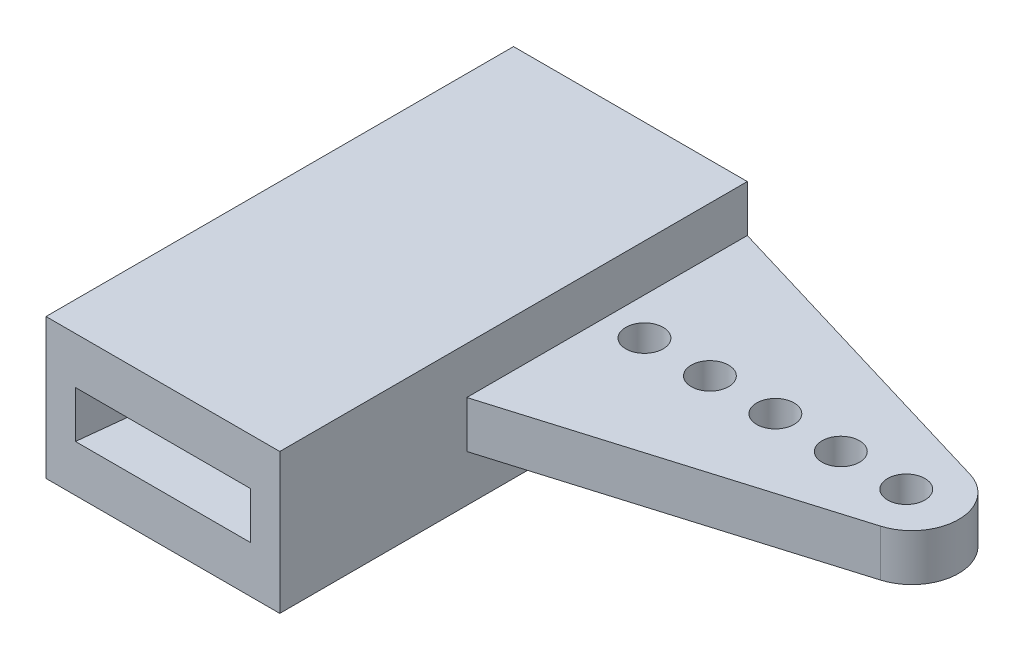
ISO-10303-21;
HEADER;
FILE_DESCRIPTION(('STEP AP214'),'2;1');
FILE_NAME('part.step','',(''),(''),'','','');
FILE_SCHEMA(('AUTOMOTIVE_DESIGN { 1 0 10303 214 1 1 1 1 }'));
ENDSEC;
DATA;
#1=APPLICATION_CONTEXT('core data for automotive mechanical design processes');
#2=APPLICATION_PROTOCOL_DEFINITION('international standard','automotive_design',2000,#1);
#3=PRODUCT_CONTEXT('',#1,'mechanical');
#4=PRODUCT('Part','Part','',(#3));
#5=PRODUCT_RELATED_PRODUCT_CATEGORY('part','',(#4));
#6=PRODUCT_DEFINITION_FORMATION('','',#4);
#7=PRODUCT_DEFINITION_CONTEXT('part definition',#1,'design');
#8=PRODUCT_DEFINITION('design','',#6,#7);
#9=PRODUCT_DEFINITION_SHAPE('','',#8);
#10=(LENGTH_UNIT() NAMED_UNIT(*) SI_UNIT(.MILLI.,.METRE.));
#11=(NAMED_UNIT(*) PLANE_ANGLE_UNIT() SI_UNIT($,.RADIAN.));
#12=(NAMED_UNIT(*) SI_UNIT($,.STERADIAN.) SOLID_ANGLE_UNIT());
#13=UNCERTAINTY_MEASURE_WITH_UNIT(LENGTH_MEASURE(1.E-05),#10,'distance_accuracy_value','');
#14=(GEOMETRIC_REPRESENTATION_CONTEXT(3) GLOBAL_UNCERTAINTY_ASSIGNED_CONTEXT((#13)) GLOBAL_UNIT_ASSIGNED_CONTEXT((#10,
#11,#12)) REPRESENTATION_CONTEXT('',''));
#15=CARTESIAN_POINT('',(0.,0.,0.));
#16=DIRECTION('',(0.,0.,1.));
#17=DIRECTION('',(1.,0.,0.));
#18=AXIS2_PLACEMENT_3D('',#15,#16,#17);
#19=CARTESIAN_POINT('',(0.,3.556,0.));
#20=DIRECTION('',(0.,1.,0.));
#21=DIRECTION('',(0.,0.,1.));
#22=AXIS2_PLACEMENT_3D('',#19,#20,#21);
#23=PLANE('',#22);
#24=CARTESIAN_POINT('',(11.303,3.556,-12.7));
#25=DIRECTION('',(0.,1.,0.));
#26=DIRECTION('',(0.,0.,1.));
#27=AXIS2_PLACEMENT_3D('',#24,#25,#26);
#28=CIRCLE('',#27,0.508000000000002);
#29=CARTESIAN_POINT('',(11.303,3.556,-12.192));
#30=VERTEX_POINT('',#29);
#31=EDGE_CURVE('E215',#30,#30,#28,.T.);
#32=ORIENTED_EDGE('',*,*,#31,.F.);
#33=EDGE_LOOP('',(#32));
#34=FACE_BOUND('',#33,.T.);
#35=CARTESIAN_POINT('',(9.525,3.556,-12.7));
#36=DIRECTION('',(0.,1.,0.));
#37=DIRECTION('',(0.,0.,1.));
#38=AXIS2_PLACEMENT_3D('',#35,#36,#37);
#39=CIRCLE('',#38,0.507999999999998);
#40=CARTESIAN_POINT('',(9.525,3.556,-12.192));
#41=VERTEX_POINT('',#40);
#42=EDGE_CURVE('E219',#41,#41,#39,.T.);
#43=ORIENTED_EDGE('',*,*,#42,.F.);
#44=EDGE_LOOP('',(#43));
#45=FACE_BOUND('',#44,.T.);
#46=CARTESIAN_POINT('',(7.747,3.556,-12.7));
#47=DIRECTION('',(0.,1.,0.));
#48=DIRECTION('',(0.,0.,1.));
#49=AXIS2_PLACEMENT_3D('',#46,#47,#48);
#50=CIRCLE('',#49,0.508000000000001);
#51=CARTESIAN_POINT('',(7.747,3.556,-12.192));
#52=VERTEX_POINT('',#51);
#53=EDGE_CURVE('E273',#52,#52,#50,.T.);
#54=ORIENTED_EDGE('',*,*,#53,.F.);
#55=EDGE_LOOP('',(#54));
#56=FACE_BOUND('',#55,.T.);
#57=CARTESIAN_POINT('',(5.969,3.556,-12.7));
#58=DIRECTION('',(0.,1.,0.));
#59=DIRECTION('',(0.,0.,1.));
#60=AXIS2_PLACEMENT_3D('',#57,#58,#59);
#61=CIRCLE('',#60,0.508);
#62=CARTESIAN_POINT('',(5.969,3.556,-12.192));
#63=VERTEX_POINT('',#62);
#64=EDGE_CURVE('E239',#63,#63,#61,.T.);
#65=ORIENTED_EDGE('',*,*,#64,.F.);
#66=EDGE_LOOP('',(#65));
#67=FACE_BOUND('',#66,.T.);
#68=CARTESIAN_POINT('',(4.191,3.556,-12.7));
#69=DIRECTION('',(0.,1.,0.));
#70=DIRECTION('',(0.,0.,1.));
#71=AXIS2_PLACEMENT_3D('',#68,#69,#70);
#72=CIRCLE('',#71,0.508);
#73=CARTESIAN_POINT('',(4.191,3.556,-12.192));
#74=VERTEX_POINT('',#73);
#75=EDGE_CURVE('E227',#74,#74,#72,.T.);
#76=ORIENTED_EDGE('',*,*,#75,.F.);
#77=EDGE_LOOP('',(#76));
#78=FACE_BOUND('',#77,.T.);
#79=DIRECTION('',(-0.957826285221151,0.,0.287347885566346));
#80=VECTOR('',#79,1.);
#81=CARTESIAN_POINT('',(-2.18463302752294,3.556,-7.28211009174312));
#82=LINE('',#81,#80);
#83=CARTESIAN_POINT('',(11.8202020592305,3.556,-11.4835606177691));
#84=VERTEX_POINT('',#83);
#85=CARTESIAN_POINT('',(3.175,3.556,-8.89));
#86=VERTEX_POINT('',#85);
#87=EDGE_CURVE('E236',#84,#86,#82,.T.);
#88=ORIENTED_EDGE('',*,*,#87,.F.);
#89=CARTESIAN_POINT('',(11.4552702445612,3.556,-12.7));
#90=DIRECTION('',(0.,1.,0.));
#91=DIRECTION('',(0.,0.,1.));
#92=AXIS2_PLACEMENT_3D('',#89,#90,#91);
#93=CIRCLE('',#92,1.27);
#94=CARTESIAN_POINT('',(11.8202020592305,3.556,-13.9164393822309));
#95=VERTEX_POINT('',#94);
#96=EDGE_CURVE('E11',#84,#95,#93,.T.);
#97=ORIENTED_EDGE('',*,*,#96,.T.);
#98=DIRECTION('',(0.957826285221152,0.,0.287347885566345));
#99=VECTOR('',#98,1.);
#100=CARTESIAN_POINT('',(4.80619266055045,3.556,-16.0206422018349));
#101=LINE('',#100,#99);
#102=CARTESIAN_POINT('',(3.175,3.556,-16.51));
#103=VERTEX_POINT('',#102);
#104=EDGE_CURVE('E230',#103,#95,#101,.T.);
#105=ORIENTED_EDGE('',*,*,#104,.F.);
#106=DIRECTION('',(0.,0.,1.));
#107=VECTOR('',#106,1.);
#108=CARTESIAN_POINT('',(3.175,3.556,0.));
#109=LINE('',#108,#107);
#110=EDGE_CURVE('E141',#103,#86,#109,.T.);
#111=ORIENTED_EDGE('',*,*,#110,.T.);
#112=EDGE_LOOP('',(#88,#97,#105,#111));
#113=FACE_BOUND('',#112,.T.);
#114=ADVANCED_FACE('F47',(#34,#45,#56,#67,#78,#113),#23,.T.);
#115=CARTESIAN_POINT('',(0.,26.4512505991963,-3.81));
#116=DIRECTION('',(0.,0.,1.));
#117=DIRECTION('',(1.,0.,0.));
#118=AXIS2_PLACEMENT_3D('',#115,#116,#117);
#119=PLANE('',#118);
#120=DIRECTION('',(1.,0.,0.));
#121=VECTOR('',#120,1.);
#122=CARTESIAN_POINT('',(0.,4.826,-3.81));
#123=LINE('',#122,#121);
#124=CARTESIAN_POINT('',(-3.175,4.826,-3.81));
#125=VERTEX_POINT('',#124);
#126=CARTESIAN_POINT('',(3.175,4.826,-3.81));
#127=VERTEX_POINT('',#126);
#128=EDGE_CURVE('E157',#125,#127,#123,.T.);
#129=ORIENTED_EDGE('',*,*,#128,.F.);
#130=DIRECTION('',(0.,-1.,0.));
#131=VECTOR('',#130,1.);
#132=CARTESIAN_POINT('',(-3.175,26.4512505991963,-3.81));
#133=LINE('',#132,#131);
#134=CARTESIAN_POINT('',(-3.175,1.016,-3.81));
#135=VERTEX_POINT('',#134);
#136=EDGE_CURVE('E220',#125,#135,#133,.T.);
#137=ORIENTED_EDGE('',*,*,#136,.T.);
#138=DIRECTION('',(-1.,0.,0.));
#139=VECTOR('',#138,1.);
#140=CARTESIAN_POINT('',(3.175,1.016,-3.81));
#141=LINE('',#140,#139);
#142=CARTESIAN_POINT('',(3.175,1.016,-3.81));
#143=VERTEX_POINT('',#142);
#144=EDGE_CURVE('E181',#143,#135,#141,.T.);
#145=ORIENTED_EDGE('',*,*,#144,.F.);
#146=DIRECTION('',(0.,-1.,0.));
#147=VECTOR('',#146,1.);
#148=CARTESIAN_POINT('',(3.175,26.4512505991963,-3.81));
#149=LINE('',#148,#147);
#150=EDGE_CURVE('E235',#127,#143,#149,.T.);
#151=ORIENTED_EDGE('',*,*,#150,.F.);
#152=EDGE_LOOP('',(#129,#137,#145,#151));
#153=FACE_BOUND('',#152,.T.);
#154=DIRECTION('',(0.,1.,0.));
#155=VECTOR('',#154,1.);
#156=CARTESIAN_POINT('',(-2.37490529268971,26.4512505991963,-3.81));
#157=LINE('',#156,#155);
#158=CARTESIAN_POINT('',(-2.37490529268971,2.286,-3.81));
#159=VERTEX_POINT('',#158);
#160=CARTESIAN_POINT('',(-2.37490529268971,3.556,-3.81));
#161=VERTEX_POINT('',#160);
#162=EDGE_CURVE('E203',#159,#161,#157,.T.);
#163=ORIENTED_EDGE('',*,*,#162,.T.);
#164=DIRECTION('',(1.,0.,0.));
#165=VECTOR('',#164,1.);
#166=CARTESIAN_POINT('',(0.,3.556,-3.81));
#167=LINE('',#166,#165);
#168=CARTESIAN_POINT('',(2.37490529268971,3.556,-3.81));
#169=VERTEX_POINT('',#168);
#170=EDGE_CURVE('E165',#161,#169,#167,.T.);
#171=ORIENTED_EDGE('',*,*,#170,.T.);
#172=DIRECTION('',(0.,1.,0.));
#173=VECTOR('',#172,1.);
#174=CARTESIAN_POINT('',(2.37490529268971,26.4512505991963,-3.81));
#175=LINE('',#174,#173);
#176=CARTESIAN_POINT('',(2.37490529268971,2.286,-3.81));
#177=VERTEX_POINT('',#176);
#178=EDGE_CURVE('E214',#177,#169,#175,.T.);
#179=ORIENTED_EDGE('',*,*,#178,.F.);
#180=DIRECTION('',(-1.,0.,0.));
#181=VECTOR('',#180,1.);
#182=CARTESIAN_POINT('',(3.175,2.286,-3.81));
#183=LINE('',#182,#181);
#184=EDGE_CURVE('E182',#177,#159,#183,.T.);
#185=ORIENTED_EDGE('',*,*,#184,.T.);
#186=EDGE_LOOP('',(#163,#171,#179,#185));
#187=FACE_BOUND('',#186,.T.);
#188=ADVANCED_FACE('F331',(#153,#187),#119,.T.);
#189=CARTESIAN_POINT('',(0.,2.286,0.));
#190=DIRECTION('',(0.,-1.,0.));
#191=DIRECTION('',(0.,0.,-1.));
#192=AXIS2_PLACEMENT_3D('',#189,#190,#191);
#193=PLANE('',#192);
#194=DIRECTION('',(0.957826285221152,0.,0.287347885566345));
#195=VECTOR('',#194,1.);
#196=CARTESIAN_POINT('',(4.80619266055045,2.286,-16.0206422018349));
#197=LINE('',#196,#195);
#198=CARTESIAN_POINT('',(3.175,2.286,-16.51));
#199=VERTEX_POINT('',#198);
#200=CARTESIAN_POINT('',(11.8202020592305,2.286,-13.9164393822309));
#201=VERTEX_POINT('',#200);
#202=EDGE_CURVE('E243',#199,#201,#197,.T.);
#203=ORIENTED_EDGE('',*,*,#202,.T.);
#204=CARTESIAN_POINT('',(11.4552702445612,2.286,-12.7));
#205=DIRECTION('',(0.,-1.,0.));
#206=DIRECTION('',(0.,0.,-1.));
#207=AXIS2_PLACEMENT_3D('',#204,#205,#206);
#208=CIRCLE('',#207,1.27);
#209=CARTESIAN_POINT('',(11.8202020592305,2.286,-11.4835606177691));
#210=VERTEX_POINT('',#209);
#211=EDGE_CURVE('E70',#201,#210,#208,.T.);
#212=ORIENTED_EDGE('',*,*,#211,.T.);
#213=DIRECTION('',(-0.957826285221151,0.,0.287347885566346));
#214=VECTOR('',#213,1.);
#215=CARTESIAN_POINT('',(-2.18463302752294,2.286,-7.28211009174312));
#216=LINE('',#215,#214);
#217=CARTESIAN_POINT('',(3.175,2.286,-8.89));
#218=VERTEX_POINT('',#217);
#219=EDGE_CURVE('E240',#210,#218,#216,.T.);
#220=ORIENTED_EDGE('',*,*,#219,.T.);
#221=DIRECTION('',(0.,0.,1.));
#222=VECTOR('',#221,1.);
#223=CARTESIAN_POINT('',(3.175,2.286,-3.81));
#224=LINE('',#223,#222);
#225=EDGE_CURVE('E147',#199,#218,#224,.T.);
#226=ORIENTED_EDGE('',*,*,#225,.F.);
#227=EDGE_LOOP('',(#203,#212,#220,#226));
#228=FACE_BOUND('',#227,.T.);
#229=CARTESIAN_POINT('',(11.303,2.286,-12.7));
#230=DIRECTION('',(0.,1.,0.));
#231=DIRECTION('',(0.,0.,1.));
#232=AXIS2_PLACEMENT_3D('',#229,#230,#231);
#233=CIRCLE('',#232,0.508000000000002);
#234=CARTESIAN_POINT('',(11.303,2.286,-12.192));
#235=VERTEX_POINT('',#234);
#236=EDGE_CURVE('E223',#235,#235,#233,.T.);
#237=ORIENTED_EDGE('',*,*,#236,.T.);
#238=EDGE_LOOP('',(#237));
#239=FACE_BOUND('',#238,.T.);
#240=CARTESIAN_POINT('',(7.747,2.286,-12.7));
#241=DIRECTION('',(0.,1.,0.));
#242=DIRECTION('',(0.,0.,1.));
#243=AXIS2_PLACEMENT_3D('',#240,#241,#242);
#244=CIRCLE('',#243,0.508000000000001);
#245=CARTESIAN_POINT('',(7.747,2.286,-12.192));
#246=VERTEX_POINT('',#245);
#247=EDGE_CURVE('E252',#246,#246,#244,.T.);
#248=ORIENTED_EDGE('',*,*,#247,.T.);
#249=EDGE_LOOP('',(#248));
#250=FACE_BOUND('',#249,.T.);
#251=CARTESIAN_POINT('',(4.191,2.286,-12.7));
#252=DIRECTION('',(0.,1.,0.));
#253=DIRECTION('',(0.,0.,1.));
#254=AXIS2_PLACEMENT_3D('',#251,#252,#253);
#255=CIRCLE('',#254,0.508);
#256=CARTESIAN_POINT('',(4.191,2.286,-12.192));
#257=VERTEX_POINT('',#256);
#258=EDGE_CURVE('E247',#257,#257,#255,.T.);
#259=ORIENTED_EDGE('',*,*,#258,.T.);
#260=EDGE_LOOP('',(#259));
#261=FACE_BOUND('',#260,.T.);
#262=CARTESIAN_POINT('',(5.969,2.286,-12.7));
#263=DIRECTION('',(0.,1.,0.));
#264=DIRECTION('',(0.,0.,1.));
#265=AXIS2_PLACEMENT_3D('',#262,#263,#264);
#266=CIRCLE('',#265,0.508);
#267=CARTESIAN_POINT('',(5.969,2.286,-12.192));
#268=VERTEX_POINT('',#267);
#269=EDGE_CURVE('E251',#268,#268,#266,.T.);
#270=ORIENTED_EDGE('',*,*,#269,.T.);
#271=EDGE_LOOP('',(#270));
#272=FACE_BOUND('',#271,.T.);
#273=CARTESIAN_POINT('',(9.525,2.286,-12.7));
#274=DIRECTION('',(0.,1.,0.));
#275=DIRECTION('',(0.,0.,1.));
#276=AXIS2_PLACEMENT_3D('',#273,#274,#275);
#277=CIRCLE('',#276,0.507999999999998);
#278=CARTESIAN_POINT('',(9.525,2.286,-12.192));
#279=VERTEX_POINT('',#278);
#280=EDGE_CURVE('E246',#279,#279,#277,.T.);
#281=ORIENTED_EDGE('',*,*,#280,.T.);
#282=EDGE_LOOP('',(#281));
#283=FACE_BOUND('',#282,.T.);
#284=ADVANCED_FACE('F320',(#228,#239,#250,#261,#272,#283),#193,.T.);
#285=CARTESIAN_POINT('',(7.747,26.4512505991963,-12.7));
#286=DIRECTION('',(0.,-1.,0.));
#287=DIRECTION('',(0.,0.,-1.));
#288=AXIS2_PLACEMENT_3D('',#285,#286,#287);
#289=CYLINDRICAL_SURFACE('',#288,0.508000000000001);
#290=ORIENTED_EDGE('',*,*,#247,.F.);
#291=EDGE_LOOP('',(#290));
#292=FACE_BOUND('',#291,.T.);
#293=ORIENTED_EDGE('',*,*,#53,.T.);
#294=EDGE_LOOP('',(#293));
#295=FACE_BOUND('',#294,.T.);
#296=ADVANCED_FACE('F372',(#292,#295),#289,.F.);
#297=CARTESIAN_POINT('',(4.191,26.4512505991963,-12.7));
#298=DIRECTION('',(0.,-1.,0.));
#299=DIRECTION('',(0.,0.,-1.));
#300=AXIS2_PLACEMENT_3D('',#297,#298,#299);
#301=CYLINDRICAL_SURFACE('',#300,0.508);
#302=ORIENTED_EDGE('',*,*,#258,.F.);
#303=EDGE_LOOP('',(#302));
#304=FACE_BOUND('',#303,.T.);
#305=ORIENTED_EDGE('',*,*,#75,.T.);
#306=EDGE_LOOP('',(#305));
#307=FACE_BOUND('',#306,.T.);
#308=ADVANCED_FACE('F376',(#304,#307),#301,.F.);
#309=CARTESIAN_POINT('',(-3.175,26.4512505991963,0.));
#310=DIRECTION('',(-1.,0.,0.));
#311=DIRECTION('',(0.,0.,1.));
#312=AXIS2_PLACEMENT_3D('',#309,#310,#311);
#313=PLANE('',#312);
#314=ORIENTED_EDGE('',*,*,#136,.F.);
#315=DIRECTION('',(0.,0.,1.));
#316=VECTOR('',#315,1.);
#317=CARTESIAN_POINT('',(-3.175,4.826,0.));
#318=LINE('',#317,#316);
#319=CARTESIAN_POINT('',(-3.175,4.826,-16.51));
#320=VERTEX_POINT('',#319);
#321=EDGE_CURVE('E148',#320,#125,#318,.T.);
#322=ORIENTED_EDGE('',*,*,#321,.F.);
#323=DIRECTION('',(0.,-1.,0.));
#324=VECTOR('',#323,1.);
#325=CARTESIAN_POINT('',(-3.175,26.4512505991963,-16.51));
#326=LINE('',#325,#324);
#327=CARTESIAN_POINT('',(-3.175,1.016,-16.51));
#328=VERTEX_POINT('',#327);
#329=EDGE_CURVE('E162',#320,#328,#326,.T.);
#330=ORIENTED_EDGE('',*,*,#329,.T.);
#331=DIRECTION('',(0.,0.,-1.));
#332=VECTOR('',#331,1.);
#333=CARTESIAN_POINT('',(-3.175,1.016,-3.81));
#334=LINE('',#333,#332);
#335=EDGE_CURVE('E186',#135,#328,#334,.T.);
#336=ORIENTED_EDGE('',*,*,#335,.F.);
#337=EDGE_LOOP('',(#314,#322,#330,#336));
#338=FACE_BOUND('',#337,.T.);
#339=ADVANCED_FACE('F329',(#338),#313,.T.);
#340=CARTESIAN_POINT('',(0.,26.4512505991963,-16.51));
#341=DIRECTION('',(0.,0.,-1.));
#342=DIRECTION('',(-1.,0.,0.));
#343=AXIS2_PLACEMENT_3D('',#340,#341,#342);
#344=PLANE('',#343);
#345=ORIENTED_EDGE('',*,*,#329,.F.);
#346=DIRECTION('',(1.,0.,0.));
#347=VECTOR('',#346,1.);
#348=CARTESIAN_POINT('',(0.,4.826,-16.51));
#349=LINE('',#348,#347);
#350=CARTESIAN_POINT('',(3.175,4.826,-16.51));
#351=VERTEX_POINT('',#350);
#352=EDGE_CURVE('E155',#320,#351,#349,.T.);
#353=ORIENTED_EDGE('',*,*,#352,.T.);
#354=DIRECTION('',(0.,-1.,0.));
#355=VECTOR('',#354,1.);
#356=CARTESIAN_POINT('',(3.175,4.826,-16.51));
#357=LINE('',#356,#355);
#358=EDGE_CURVE('E135',#351,#103,#357,.T.);
#359=ORIENTED_EDGE('',*,*,#358,.T.);
#360=DIRECTION('',(0.,-1.,0.));
#361=VECTOR('',#360,1.);
#362=CARTESIAN_POINT('',(3.175,26.4512505991963,-16.51));
#363=LINE('',#362,#361);
#364=EDGE_CURVE('E226',#103,#199,#363,.T.);
#365=ORIENTED_EDGE('',*,*,#364,.T.);
#366=DIRECTION('',(0.,1.,0.));
#367=VECTOR('',#366,1.);
#368=CARTESIAN_POINT('',(3.175,1.016,-16.51));
#369=LINE('',#368,#367);
#370=CARTESIAN_POINT('',(3.175,1.016,-16.51));
#371=VERTEX_POINT('',#370);
#372=EDGE_CURVE('E193',#371,#199,#369,.T.);
#373=ORIENTED_EDGE('',*,*,#372,.F.);
#374=DIRECTION('',(1.,0.,0.));
#375=VECTOR('',#374,1.);
#376=CARTESIAN_POINT('',(3.175,1.016,-16.51));
#377=LINE('',#376,#375);
#378=EDGE_CURVE('E190',#328,#371,#377,.T.);
#379=ORIENTED_EDGE('',*,*,#378,.F.);
#380=EDGE_LOOP('',(#345,#353,#359,#365,#373,#379));
#381=FACE_BOUND('',#380,.T.);
#382=ADVANCED_FACE('F160',(#381),#344,.T.);
#383=CARTESIAN_POINT('',(4.80619266055045,26.4512505991963,-16.0206422018349));
#384=DIRECTION('',(0.287347885566345,0.,-0.957826285221151));
#385=DIRECTION('',(-0.957826285221152,0.,-0.287347885566345));
#386=AXIS2_PLACEMENT_3D('',#383,#384,#385);
#387=PLANE('',#386);
#388=ORIENTED_EDGE('',*,*,#104,.T.);
#389=DIRECTION('',(0.,-1.,0.));
#390=VECTOR('',#389,1.);
#391=CARTESIAN_POINT('',(11.8202020592305,26.4512505991963,-13.9164393822309));
#392=LINE('',#391,#390);
#393=EDGE_CURVE('E298',#95,#201,#392,.T.);
#394=ORIENTED_EDGE('',*,*,#393,.T.);
#395=ORIENTED_EDGE('',*,*,#202,.F.);
#396=ORIENTED_EDGE('',*,*,#364,.F.);
#397=EDGE_LOOP('',(#388,#394,#395,#396));
#398=FACE_BOUND('',#397,.T.);
#399=ADVANCED_FACE('F316',(#398),#387,.T.);
#400=CARTESIAN_POINT('',(-2.18463302752294,26.4512505991963,-7.28211009174312));
#401=DIRECTION('',(0.287347885566346,0.,0.957826285221151));
#402=DIRECTION('',(0.957826285221151,0.,-0.287347885566346));
#403=AXIS2_PLACEMENT_3D('',#400,#401,#402);
#404=PLANE('',#403);
#405=ORIENTED_EDGE('',*,*,#219,.F.);
#406=DIRECTION('',(0.,-1.,0.));
#407=VECTOR('',#406,1.);
#408=CARTESIAN_POINT('',(11.8202020592305,26.4512505991963,-11.4835606177691));
#409=LINE('',#408,#407);
#410=EDGE_CURVE('E56',#210,#84,#409,.F.);
#411=ORIENTED_EDGE('',*,*,#410,.T.);
#412=ORIENTED_EDGE('',*,*,#87,.T.);
#413=DIRECTION('',(0.,-1.,0.));
#414=VECTOR('',#413,1.);
#415=CARTESIAN_POINT('',(3.175,26.4512505991963,-8.89));
#416=LINE('',#415,#414);
#417=EDGE_CURVE('E231',#86,#218,#416,.T.);
#418=ORIENTED_EDGE('',*,*,#417,.T.);
#419=EDGE_LOOP('',(#405,#411,#412,#418));
#420=FACE_BOUND('',#419,.T.);
#421=ADVANCED_FACE('F417',(#420),#404,.T.);
#422=CARTESIAN_POINT('',(3.175,26.4512505991963,0.));
#423=DIRECTION('',(1.,0.,0.));
#424=DIRECTION('',(0.,0.,-1.));
#425=AXIS2_PLACEMENT_3D('',#422,#423,#424);
#426=PLANE('',#425);
#427=ORIENTED_EDGE('',*,*,#417,.F.);
#428=ORIENTED_EDGE('',*,*,#110,.F.);
#429=ORIENTED_EDGE('',*,*,#358,.F.);
#430=DIRECTION('',(0.,0.,1.));
#431=VECTOR('',#430,1.);
#432=CARTESIAN_POINT('',(3.175,4.826,0.));
#433=LINE('',#432,#431);
#434=EDGE_CURVE('E139',#351,#127,#433,.T.);
#435=ORIENTED_EDGE('',*,*,#434,.T.);
#436=ORIENTED_EDGE('',*,*,#150,.T.);
#437=DIRECTION('',(0.,0.,1.));
#438=VECTOR('',#437,1.);
#439=CARTESIAN_POINT('',(3.175,1.016,-3.81));
#440=LINE('',#439,#438);
#441=EDGE_CURVE('E177',#371,#143,#440,.T.);
#442=ORIENTED_EDGE('',*,*,#441,.F.);
#443=ORIENTED_EDGE('',*,*,#372,.T.);
#444=ORIENTED_EDGE('',*,*,#225,.T.);
#445=EDGE_LOOP('',(#427,#428,#429,#435,#436,#442,#443,#444));
#446=FACE_BOUND('',#445,.T.);
#447=ADVANCED_FACE('F138',(#446),#426,.T.);
#448=CARTESIAN_POINT('',(5.969,26.4512505991963,-12.7));
#449=DIRECTION('',(0.,-1.,0.));
#450=DIRECTION('',(0.,0.,-1.));
#451=AXIS2_PLACEMENT_3D('',#448,#449,#450);
#452=CYLINDRICAL_SURFACE('',#451,0.508);
#453=ORIENTED_EDGE('',*,*,#269,.F.);
#454=EDGE_LOOP('',(#453));
#455=FACE_BOUND('',#454,.T.);
#456=ORIENTED_EDGE('',*,*,#64,.T.);
#457=EDGE_LOOP('',(#456));
#458=FACE_BOUND('',#457,.T.);
#459=ADVANCED_FACE('F388',(#455,#458),#452,.F.);
#460=CARTESIAN_POINT('',(9.525,26.4512505991963,-12.7));
#461=DIRECTION('',(0.,-1.,0.));
#462=DIRECTION('',(0.,0.,-1.));
#463=AXIS2_PLACEMENT_3D('',#460,#461,#462);
#464=CYLINDRICAL_SURFACE('',#463,0.507999999999998);
#465=ORIENTED_EDGE('',*,*,#280,.F.);
#466=EDGE_LOOP('',(#465));
#467=FACE_BOUND('',#466,.T.);
#468=ORIENTED_EDGE('',*,*,#42,.T.);
#469=EDGE_LOOP('',(#468));
#470=FACE_BOUND('',#469,.T.);
#471=ADVANCED_FACE('F389',(#467,#470),#464,.F.);
#472=CARTESIAN_POINT('',(11.303,26.4512505991963,-12.7));
#473=DIRECTION('',(0.,-1.,0.));
#474=DIRECTION('',(0.,0.,-1.));
#475=AXIS2_PLACEMENT_3D('',#472,#473,#474);
#476=CYLINDRICAL_SURFACE('',#475,0.508000000000002);
#477=ORIENTED_EDGE('',*,*,#236,.F.);
#478=EDGE_LOOP('',(#477));
#479=FACE_BOUND('',#478,.T.);
#480=ORIENTED_EDGE('',*,*,#31,.T.);
#481=EDGE_LOOP('',(#480));
#482=FACE_BOUND('',#481,.T.);
#483=ADVANCED_FACE('F392',(#479,#482),#476,.F.);
#484=CARTESIAN_POINT('',(2.75931495587774,2.286,-0.302402836898391));
#485=DIRECTION('',(0.994048198942079,0.,-0.108941168435119));
#486=DIRECTION('',(-0.108941168435119,0.,-0.994048198942079));
#487=AXIS2_PLACEMENT_3D('',#484,#485,#486);
#488=PLANE('',#487);
#489=ORIENTED_EDGE('',*,*,#178,.T.);
#490=DIRECTION('',(-0.108941168435119,0.,-0.994048198942079));
#491=VECTOR('',#490,1.);
#492=CARTESIAN_POINT('',(2.75931495587774,3.556,-0.30240283689839));
#493=LINE('',#492,#491);
#494=CARTESIAN_POINT('',(1.24451166089778,3.556,-14.1244272263572));
#495=VERTEX_POINT('',#494);
#496=EDGE_CURVE('E209',#169,#495,#493,.T.);
#497=ORIENTED_EDGE('',*,*,#496,.T.);
#498=DIRECTION('',(0.,1.,0.));
#499=VECTOR('',#498,1.);
#500=CARTESIAN_POINT('',(1.24451166089778,2.286,-14.1244272263572));
#501=LINE('',#500,#499);
#502=CARTESIAN_POINT('',(1.24451166089778,2.286,-14.1244272263572));
#503=VERTEX_POINT('',#502);
#504=EDGE_CURVE('E289',#503,#495,#501,.T.);
#505=ORIENTED_EDGE('',*,*,#504,.F.);
#506=DIRECTION('',(-0.108941168435119,0.,-0.994048198942079));
#507=VECTOR('',#506,1.);
#508=CARTESIAN_POINT('',(2.75931495587774,2.286,-0.302402836898391));
#509=LINE('',#508,#507);
#510=EDGE_CURVE('E208',#177,#503,#509,.T.);
#511=ORIENTED_EDGE('',*,*,#510,.F.);
#512=EDGE_LOOP('',(#489,#497,#505,#511));
#513=FACE_BOUND('',#512,.T.);
#514=ADVANCED_FACE('F350',(#513),#488,.F.);
#515=CARTESIAN_POINT('',(0.,2.286,-13.9880369038219));
#516=DIRECTION('',(0.,1.,0.));
#517=DIRECTION('',(0.,0.,1.));
#518=AXIS2_PLACEMENT_3D('',#515,#516,#517);
#519=CYLINDRICAL_SURFACE('',#518,1.25196309617809);
#520=CARTESIAN_POINT('',(0.,3.556,-13.9880369038219));
#521=DIRECTION('',(0.,1.,0.));
#522=DIRECTION('',(0.,0.,1.));
#523=AXIS2_PLACEMENT_3D('',#520,#521,#522);
#524=CIRCLE('',#523,1.25196309617809);
#525=CARTESIAN_POINT('',(-1.24451166089778,3.556,-14.1244272263572));
#526=VERTEX_POINT('',#525);
#527=EDGE_CURVE('E207',#526,#495,#524,.F.);
#528=ORIENTED_EDGE('',*,*,#527,.F.);
#529=DIRECTION('',(0.,1.,0.));
#530=VECTOR('',#529,1.);
#531=CARTESIAN_POINT('',(-1.24451166089778,2.286,-14.1244272263572));
#532=LINE('',#531,#530);
#533=CARTESIAN_POINT('',(-1.24451166089778,2.286,-14.1244272263572));
#534=VERTEX_POINT('',#533);
#535=EDGE_CURVE('E294',#534,#526,#532,.T.);
#536=ORIENTED_EDGE('',*,*,#535,.F.);
#537=CARTESIAN_POINT('',(0.,2.286,-13.9880369038219));
#538=DIRECTION('',(0.,1.,0.));
#539=DIRECTION('',(0.,0.,1.));
#540=AXIS2_PLACEMENT_3D('',#537,#538,#539);
#541=CIRCLE('',#540,1.25196309617809);
#542=EDGE_CURVE('E213',#534,#503,#541,.F.);
#543=ORIENTED_EDGE('',*,*,#542,.T.);
#544=ORIENTED_EDGE('',*,*,#504,.T.);
#545=EDGE_LOOP('',(#528,#536,#543,#544));
#546=FACE_BOUND('',#545,.T.);
#547=ADVANCED_FACE('F348',(#546),#519,.F.);
#548=CARTESIAN_POINT('',(-2.75931495587774,2.286,-0.302402836898391));
#549=DIRECTION('',(0.994048198942079,0.,0.108941168435119));
#550=DIRECTION('',(0.108941168435119,0.,-0.994048198942079));
#551=AXIS2_PLACEMENT_3D('',#548,#549,#550);
#552=PLANE('',#551);
#553=DIRECTION('',(0.108941168435119,0.,-0.994048198942079));
#554=VECTOR('',#553,1.);
#555=CARTESIAN_POINT('',(-2.75931495587774,2.286,-0.302402836898391));
#556=LINE('',#555,#554);
#557=EDGE_CURVE('E293',#159,#534,#556,.T.);
#558=ORIENTED_EDGE('',*,*,#557,.T.);
#559=ORIENTED_EDGE('',*,*,#535,.T.);
#560=DIRECTION('',(0.108941168435119,0.,-0.994048198942079));
#561=VECTOR('',#560,1.);
#562=CARTESIAN_POINT('',(-2.75931495587774,3.556,-0.30240283689839));
#563=LINE('',#562,#561);
#564=EDGE_CURVE('E204',#161,#526,#563,.T.);
#565=ORIENTED_EDGE('',*,*,#564,.F.);
#566=ORIENTED_EDGE('',*,*,#162,.F.);
#567=EDGE_LOOP('',(#558,#559,#565,#566));
#568=FACE_BOUND('',#567,.T.);
#569=ADVANCED_FACE('F340',(#568),#552,.T.);
#570=CARTESIAN_POINT('',(0.,2.286,0.));
#571=DIRECTION('',(0.,1.,0.));
#572=DIRECTION('',(0.,0.,1.));
#573=AXIS2_PLACEMENT_3D('',#570,#571,#572);
#574=PLANE('',#573);
#575=ORIENTED_EDGE('',*,*,#557,.F.);
#576=ORIENTED_EDGE('',*,*,#184,.F.);
#577=ORIENTED_EDGE('',*,*,#510,.T.);
#578=ORIENTED_EDGE('',*,*,#542,.F.);
#579=EDGE_LOOP('',(#575,#576,#577,#578));
#580=FACE_BOUND('',#579,.T.);
#581=ADVANCED_FACE('F344',(#580),#574,.T.);
#582=CARTESIAN_POINT('',(0.,1.016,0.));
#583=DIRECTION('',(0.,1.,0.));
#584=DIRECTION('',(0.,0.,1.));
#585=AXIS2_PLACEMENT_3D('',#582,#583,#584);
#586=PLANE('',#585);
#587=ORIENTED_EDGE('',*,*,#441,.T.);
#588=ORIENTED_EDGE('',*,*,#144,.T.);
#589=ORIENTED_EDGE('',*,*,#335,.T.);
#590=ORIENTED_EDGE('',*,*,#378,.T.);
#591=EDGE_LOOP('',(#587,#588,#589,#590));
#592=FACE_BOUND('',#591,.T.);
#593=ADVANCED_FACE('F326',(#592),#586,.F.);
#594=CARTESIAN_POINT('',(0.,4.826,0.));
#595=DIRECTION('',(0.,-1.,0.));
#596=DIRECTION('',(0.,0.,-1.));
#597=AXIS2_PLACEMENT_3D('',#594,#595,#596);
#598=PLANE('',#597);
#599=ORIENTED_EDGE('',*,*,#352,.F.);
#600=ORIENTED_EDGE('',*,*,#321,.T.);
#601=ORIENTED_EDGE('',*,*,#128,.T.);
#602=ORIENTED_EDGE('',*,*,#434,.F.);
#603=EDGE_LOOP('',(#599,#600,#601,#602));
#604=FACE_BOUND('',#603,.T.);
#605=ADVANCED_FACE('F153',(#604),#598,.F.);
#606=CARTESIAN_POINT('',(0.,3.556,0.));
#607=DIRECTION('',(0.,-1.,0.));
#608=DIRECTION('',(0.,0.,-1.));
#609=AXIS2_PLACEMENT_3D('',#606,#607,#608);
#610=PLANE('',#609);
#611=ORIENTED_EDGE('',*,*,#170,.F.);
#612=ORIENTED_EDGE('',*,*,#564,.T.);
#613=ORIENTED_EDGE('',*,*,#527,.T.);
#614=ORIENTED_EDGE('',*,*,#496,.F.);
#615=EDGE_LOOP('',(#611,#612,#613,#614));
#616=FACE_BOUND('',#615,.T.);
#617=ADVANCED_FACE('F352',(#616),#610,.T.);
#618=CARTESIAN_POINT('',(11.4552702445612,26.4512505991963,-12.7));
#619=DIRECTION('',(0.,-1.,0.));
#620=DIRECTION('',(0.,0.,-1.));
#621=AXIS2_PLACEMENT_3D('',#618,#619,#620);
#622=CYLINDRICAL_SURFACE('',#621,1.27);
#623=ORIENTED_EDGE('',*,*,#96,.F.);
#624=ORIENTED_EDGE('',*,*,#410,.F.);
#625=ORIENTED_EDGE('',*,*,#211,.F.);
#626=ORIENTED_EDGE('',*,*,#393,.F.);
#627=EDGE_LOOP('',(#623,#624,#625,#626));
#628=FACE_BOUND('',#627,.T.);
#629=ADVANCED_FACE('F49',(#628),#622,.T.);
#630=CLOSED_SHELL('',(#114,#188,#284,#296,#308,#339,#382,#399,#421,#447,#459,#471,#483,#514,
#547,#569,#581,#593,#605,#617,#629));
#631=MANIFOLD_SOLID_BREP('B2',#630);
#632=ADVANCED_BREP_SHAPE_REPRESENTATION('',(#18,#631),#14);
#633=SHAPE_DEFINITION_REPRESENTATION(#9,#632);
ENDSEC;
END-ISO-10303-21;
